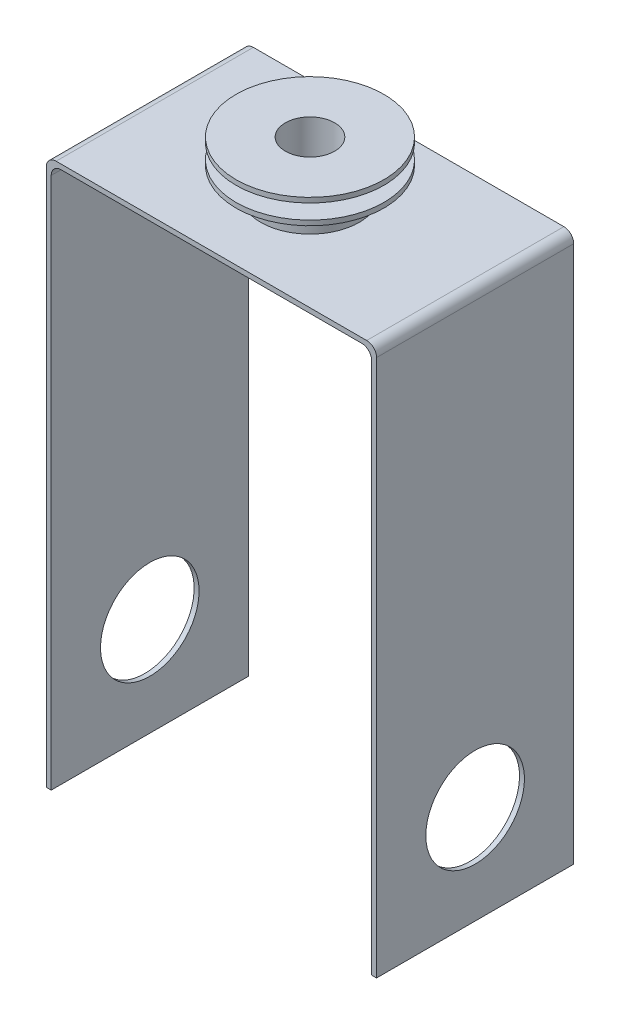
ISO-10303-21;
HEADER;
FILE_DESCRIPTION(('STEP AP214'),'2;1');
FILE_NAME('part.step','',(''),(''),'','','');
FILE_SCHEMA(('AUTOMOTIVE_DESIGN { 1 0 10303 214 1 1 1 1 }'));
ENDSEC;
DATA;
#1=APPLICATION_CONTEXT('core data for automotive mechanical design processes');
#2=APPLICATION_PROTOCOL_DEFINITION('international standard','automotive_design',2000,#1);
#3=PRODUCT_CONTEXT('',#1,'mechanical');
#4=PRODUCT('Part','Part','',(#3));
#5=PRODUCT_RELATED_PRODUCT_CATEGORY('part','',(#4));
#6=PRODUCT_DEFINITION_FORMATION('','',#4);
#7=PRODUCT_DEFINITION_CONTEXT('part definition',#1,'design');
#8=PRODUCT_DEFINITION('design','',#6,#7);
#9=PRODUCT_DEFINITION_SHAPE('','',#8);
#10=(LENGTH_UNIT() NAMED_UNIT(*) SI_UNIT(.MILLI.,.METRE.));
#11=(NAMED_UNIT(*) PLANE_ANGLE_UNIT() SI_UNIT($,.RADIAN.));
#12=(NAMED_UNIT(*) SI_UNIT($,.STERADIAN.) SOLID_ANGLE_UNIT());
#13=UNCERTAINTY_MEASURE_WITH_UNIT(LENGTH_MEASURE(1.E-05),#10,'distance_accuracy_value','');
#14=(GEOMETRIC_REPRESENTATION_CONTEXT(3) GLOBAL_UNCERTAINTY_ASSIGNED_CONTEXT((#13)) GLOBAL_UNIT_ASSIGNED_CONTEXT((#10,
#11,#12)) REPRESENTATION_CONTEXT('',''));
#15=CARTESIAN_POINT('',(0.,0.,0.));
#16=DIRECTION('',(0.,0.,1.));
#17=DIRECTION('',(1.,0.,0.));
#18=AXIS2_PLACEMENT_3D('',#15,#16,#17);
#19=CARTESIAN_POINT('',(-40.005,113.03,50.8));
#20=DIRECTION('',(0.,0.,-1.));
#21=DIRECTION('',(-1.,0.,0.));
#22=AXIS2_PLACEMENT_3D('',#19,#20,#21);
#23=CYLINDRICAL_SURFACE('',#22,2.54);
#24=CARTESIAN_POINT('',(-40.005,113.03,0.));
#25=DIRECTION('',(0.,0.,-1.));
#26=DIRECTION('',(-1.,0.,0.));
#27=AXIS2_PLACEMENT_3D('',#24,#25,#26);
#28=CIRCLE('',#27,2.54);
#29=CARTESIAN_POINT('',(-42.545,113.03,0.));
#30=VERTEX_POINT('',#29);
#31=CARTESIAN_POINT('',(-40.005,115.57,0.));
#32=VERTEX_POINT('',#31);
#33=EDGE_CURVE('E170',#30,#32,#28,.T.);
#34=ORIENTED_EDGE('',*,*,#33,.F.);
#35=DIRECTION('',(0.,0.,-1.));
#36=VECTOR('',#35,1.);
#37=CARTESIAN_POINT('',(-42.545,113.03,50.8));
#38=LINE('',#37,#36);
#39=CARTESIAN_POINT('',(-42.545,113.03,50.8));
#40=VERTEX_POINT('',#39);
#41=EDGE_CURVE('E11',#40,#30,#38,.T.);
#42=ORIENTED_EDGE('',*,*,#41,.F.);
#43=CARTESIAN_POINT('',(-40.005,113.03,50.8));
#44=DIRECTION('',(0.,0.,-1.));
#45=DIRECTION('',(-1.,0.,0.));
#46=AXIS2_PLACEMENT_3D('',#43,#44,#45);
#47=CIRCLE('',#46,2.54);
#48=CARTESIAN_POINT('',(-40.005,115.57,50.8));
#49=VERTEX_POINT('',#48);
#50=EDGE_CURVE('E211',#40,#49,#47,.T.);
#51=ORIENTED_EDGE('',*,*,#50,.T.);
#52=DIRECTION('',(0.,0.,-1.));
#53=VECTOR('',#52,1.);
#54=CARTESIAN_POINT('',(-40.005,115.57,50.8));
#55=LINE('',#54,#53);
#56=EDGE_CURVE('E45',#49,#32,#55,.T.);
#57=ORIENTED_EDGE('',*,*,#56,.T.);
#58=EDGE_LOOP('',(#34,#42,#51,#57));
#59=FACE_BOUND('',#58,.T.);
#60=ADVANCED_FACE('F42',(#59),#23,.T.);
#61=CARTESIAN_POINT('',(-42.545,113.03,50.8));
#62=DIRECTION('',(1.,0.,0.));
#63=DIRECTION('',(0.,0.,-1.));
#64=AXIS2_PLACEMENT_3D('',#61,#62,#63);
#65=PLANE('',#64);
#66=CARTESIAN_POINT('',(-42.545,0.,25.4));
#67=DIRECTION('',(-1.,0.,0.));
#68=DIRECTION('',(0.,0.,1.));
#69=AXIS2_PLACEMENT_3D('',#66,#67,#68);
#70=CIRCLE('',#69,12.7);
#71=CARTESIAN_POINT('',(-42.545,0.,38.1));
#72=VERTEX_POINT('',#71);
#73=EDGE_CURVE('E286',#72,#72,#70,.T.);
#74=ORIENTED_EDGE('',*,*,#73,.F.);
#75=EDGE_LOOP('',(#74));
#76=FACE_BOUND('',#75,.T.);
#77=DIRECTION('',(0.,-1.,0.));
#78=VECTOR('',#77,1.);
#79=CARTESIAN_POINT('',(-42.545,113.03,0.));
#80=LINE('',#79,#78);
#81=CARTESIAN_POINT('',(-42.545,-25.4,0.));
#82=VERTEX_POINT('',#81);
#83=EDGE_CURVE('E100',#30,#82,#80,.T.);
#84=ORIENTED_EDGE('',*,*,#83,.T.);
#85=DIRECTION('',(0.,0.,-1.));
#86=VECTOR('',#85,1.);
#87=CARTESIAN_POINT('',(-42.545,-25.4,50.8));
#88=LINE('',#87,#86);
#89=CARTESIAN_POINT('',(-42.545,-25.4,50.8));
#90=VERTEX_POINT('',#89);
#91=EDGE_CURVE('E52',#90,#82,#88,.T.);
#92=ORIENTED_EDGE('',*,*,#91,.F.);
#93=DIRECTION('',(0.,-1.,0.));
#94=VECTOR('',#93,1.);
#95=CARTESIAN_POINT('',(-42.545,113.03,50.8));
#96=LINE('',#95,#94);
#97=EDGE_CURVE('E143',#40,#90,#96,.T.);
#98=ORIENTED_EDGE('',*,*,#97,.F.);
#99=ORIENTED_EDGE('',*,*,#41,.T.);
#100=EDGE_LOOP('',(#84,#92,#98,#99));
#101=FACE_BOUND('',#100,.T.);
#102=ADVANCED_FACE('F356',(#76,#101),#65,.F.);
#103=CARTESIAN_POINT('',(-42.545,-25.4,50.8));
#104=DIRECTION('',(0.,1.,0.));
#105=DIRECTION('',(-1.,0.,0.));
#106=AXIS2_PLACEMENT_3D('',#103,#104,#105);
#107=PLANE('',#106);
#108=DIRECTION('',(1.,0.,0.));
#109=VECTOR('',#108,1.);
#110=CARTESIAN_POINT('',(-42.545,-25.4,0.));
#111=LINE('',#110,#109);
#112=CARTESIAN_POINT('',(-41.275,-25.4,0.));
#113=VERTEX_POINT('',#112);
#114=EDGE_CURVE('E151',#82,#113,#111,.T.);
#115=ORIENTED_EDGE('',*,*,#114,.T.);
#116=DIRECTION('',(0.,0.,-1.));
#117=VECTOR('',#116,1.);
#118=CARTESIAN_POINT('',(-41.275,-25.4,50.8));
#119=LINE('',#118,#117);
#120=CARTESIAN_POINT('',(-41.275,-25.4,50.8));
#121=VERTEX_POINT('',#120);
#122=EDGE_CURVE('E148',#121,#113,#119,.T.);
#123=ORIENTED_EDGE('',*,*,#122,.F.);
#124=DIRECTION('',(1.,0.,0.));
#125=VECTOR('',#124,1.);
#126=CARTESIAN_POINT('',(-42.545,-25.4,50.8));
#127=LINE('',#126,#125);
#128=EDGE_CURVE('E137',#90,#121,#127,.T.);
#129=ORIENTED_EDGE('',*,*,#128,.F.);
#130=ORIENTED_EDGE('',*,*,#91,.T.);
#131=EDGE_LOOP('',(#115,#123,#129,#130));
#132=FACE_BOUND('',#131,.T.);
#133=ADVANCED_FACE('F149',(#132),#107,.F.);
#134=CARTESIAN_POINT('',(-41.275,111.76,50.8));
#135=DIRECTION('',(1.,0.,0.));
#136=DIRECTION('',(0.,1.,0.));
#137=AXIS2_PLACEMENT_3D('',#134,#135,#136);
#138=PLANE('',#137);
#139=CARTESIAN_POINT('',(-41.275,0.,25.4));
#140=DIRECTION('',(1.,0.,0.));
#141=DIRECTION('',(0.,1.,0.));
#142=AXIS2_PLACEMENT_3D('',#139,#140,#141);
#143=CIRCLE('',#142,12.7);
#144=CARTESIAN_POINT('',(-41.275,12.7,25.4));
#145=VERTEX_POINT('',#144);
#146=EDGE_CURVE('E175',#145,#145,#143,.T.);
#147=ORIENTED_EDGE('',*,*,#146,.F.);
#148=EDGE_LOOP('',(#147));
#149=FACE_BOUND('',#148,.T.);
#150=DIRECTION('',(0.,-1.,0.));
#151=VECTOR('',#150,1.);
#152=CARTESIAN_POINT('',(-41.275,111.76,0.));
#153=LINE('',#152,#151);
#154=CARTESIAN_POINT('',(-41.275,111.76,0.));
#155=VERTEX_POINT('',#154);
#156=EDGE_CURVE('E205',#155,#113,#153,.T.);
#157=ORIENTED_EDGE('',*,*,#156,.F.);
#158=DIRECTION('',(0.,0.,-1.));
#159=VECTOR('',#158,1.);
#160=CARTESIAN_POINT('',(-41.275,111.76,50.8));
#161=LINE('',#160,#159);
#162=CARTESIAN_POINT('',(-41.275,111.76,50.8));
#163=VERTEX_POINT('',#162);
#164=EDGE_CURVE('E156',#163,#155,#161,.T.);
#165=ORIENTED_EDGE('',*,*,#164,.F.);
#166=DIRECTION('',(0.,-1.,0.));
#167=VECTOR('',#166,1.);
#168=CARTESIAN_POINT('',(-41.275,111.76,50.8));
#169=LINE('',#168,#167);
#170=EDGE_CURVE('E142',#163,#121,#169,.T.);
#171=ORIENTED_EDGE('',*,*,#170,.T.);
#172=ORIENTED_EDGE('',*,*,#122,.T.);
#173=EDGE_LOOP('',(#157,#165,#171,#172));
#174=FACE_BOUND('',#173,.T.);
#175=ADVANCED_FACE('F158',(#149,#174),#138,.T.);
#176=CARTESIAN_POINT('',(-38.735,111.76,50.8));
#177=DIRECTION('',(0.,0.,-1.));
#178=DIRECTION('',(-1.,0.,0.));
#179=AXIS2_PLACEMENT_3D('',#176,#177,#178);
#180=CYLINDRICAL_SURFACE('',#179,2.54);
#181=CARTESIAN_POINT('',(-38.735,111.76,0.));
#182=DIRECTION('',(0.,0.,-1.));
#183=DIRECTION('',(-1.,0.,0.));
#184=AXIS2_PLACEMENT_3D('',#181,#182,#183);
#185=CIRCLE('',#184,2.54);
#186=CARTESIAN_POINT('',(-38.735,114.3,0.));
#187=VERTEX_POINT('',#186);
#188=EDGE_CURVE('E202',#155,#187,#185,.T.);
#189=ORIENTED_EDGE('',*,*,#188,.T.);
#190=DIRECTION('',(0.,0.,-1.));
#191=VECTOR('',#190,1.);
#192=CARTESIAN_POINT('',(-38.735,114.3,50.8));
#193=LINE('',#192,#191);
#194=CARTESIAN_POINT('',(-38.735,114.3,50.8));
#195=VERTEX_POINT('',#194);
#196=EDGE_CURVE('E217',#195,#187,#193,.T.);
#197=ORIENTED_EDGE('',*,*,#196,.F.);
#198=CARTESIAN_POINT('',(-38.735,111.76,50.8));
#199=DIRECTION('',(0.,0.,-1.));
#200=DIRECTION('',(-1.,0.,0.));
#201=AXIS2_PLACEMENT_3D('',#198,#199,#200);
#202=CIRCLE('',#201,2.54);
#203=EDGE_CURVE('E161',#163,#195,#202,.T.);
#204=ORIENTED_EDGE('',*,*,#203,.F.);
#205=ORIENTED_EDGE('',*,*,#164,.T.);
#206=EDGE_LOOP('',(#189,#197,#204,#205));
#207=FACE_BOUND('',#206,.T.);
#208=ADVANCED_FACE('F248',(#207),#180,.F.);
#209=CARTESIAN_POINT('',(-38.735,114.3,50.8));
#210=DIRECTION('',(0.,1.,0.));
#211=DIRECTION('',(0.,0.,1.));
#212=AXIS2_PLACEMENT_3D('',#209,#210,#211);
#213=PLANE('',#212);
#214=CARTESIAN_POINT('',(0.,114.3,25.4));
#215=DIRECTION('',(0.,1.,0.));
#216=DIRECTION('',(0.,0.,1.));
#217=AXIS2_PLACEMENT_3D('',#214,#215,#216);
#218=CIRCLE('',#217,6.35);
#219=CARTESIAN_POINT('',(0.,114.3,31.75));
#220=VERTEX_POINT('',#219);
#221=EDGE_CURVE('E306',#220,#220,#218,.F.);
#222=ORIENTED_EDGE('',*,*,#221,.F.);
#223=EDGE_LOOP('',(#222));
#224=FACE_BOUND('',#223,.T.);
#225=DIRECTION('',(1.,0.,0.));
#226=VECTOR('',#225,1.);
#227=CARTESIAN_POINT('',(-38.735,114.3,0.));
#228=LINE('',#227,#226);
#229=CARTESIAN_POINT('',(38.735,114.3,0.));
#230=VERTEX_POINT('',#229);
#231=EDGE_CURVE('E198',#187,#230,#228,.T.);
#232=ORIENTED_EDGE('',*,*,#231,.T.);
#233=DIRECTION('',(0.,0.,-1.));
#234=VECTOR('',#233,1.);
#235=CARTESIAN_POINT('',(38.735,114.3,50.8));
#236=LINE('',#235,#234);
#237=CARTESIAN_POINT('',(38.735,114.3,50.8));
#238=VERTEX_POINT('',#237);
#239=EDGE_CURVE('E221',#238,#230,#236,.T.);
#240=ORIENTED_EDGE('',*,*,#239,.F.);
#241=DIRECTION('',(1.,0.,0.));
#242=VECTOR('',#241,1.);
#243=CARTESIAN_POINT('',(-38.735,114.3,50.8));
#244=LINE('',#243,#242);
#245=EDGE_CURVE('E164',#195,#238,#244,.T.);
#246=ORIENTED_EDGE('',*,*,#245,.F.);
#247=ORIENTED_EDGE('',*,*,#196,.T.);
#248=EDGE_LOOP('',(#232,#240,#246,#247));
#249=FACE_BOUND('',#248,.T.);
#250=ADVANCED_FACE('F251',(#224,#249),#213,.F.);
#251=CARTESIAN_POINT('',(38.735,111.76,50.8));
#252=DIRECTION('',(0.,0.,-1.));
#253=DIRECTION('',(-1.,0.,0.));
#254=AXIS2_PLACEMENT_3D('',#251,#252,#253);
#255=CYLINDRICAL_SURFACE('',#254,2.54);
#256=CARTESIAN_POINT('',(38.735,111.76,0.));
#257=DIRECTION('',(0.,0.,1.));
#258=DIRECTION('',(1.,0.,0.));
#259=AXIS2_PLACEMENT_3D('',#256,#257,#258);
#260=CIRCLE('',#259,2.54);
#261=CARTESIAN_POINT('',(41.275,111.76,0.));
#262=VERTEX_POINT('',#261);
#263=EDGE_CURVE('E194',#262,#230,#260,.T.);
#264=ORIENTED_EDGE('',*,*,#263,.F.);
#265=DIRECTION('',(0.,0.,-1.));
#266=VECTOR('',#265,1.);
#267=CARTESIAN_POINT('',(41.275,111.76,50.8));
#268=LINE('',#267,#266);
#269=CARTESIAN_POINT('',(41.275,111.76,50.8));
#270=VERTEX_POINT('',#269);
#271=EDGE_CURVE('E224',#270,#262,#268,.T.);
#272=ORIENTED_EDGE('',*,*,#271,.F.);
#273=CARTESIAN_POINT('',(38.735,111.76,50.8));
#274=DIRECTION('',(0.,0.,1.));
#275=DIRECTION('',(1.,0.,0.));
#276=AXIS2_PLACEMENT_3D('',#273,#274,#275);
#277=CIRCLE('',#276,2.54);
#278=EDGE_CURVE('E256',#270,#238,#277,.T.);
#279=ORIENTED_EDGE('',*,*,#278,.T.);
#280=ORIENTED_EDGE('',*,*,#239,.T.);
#281=EDGE_LOOP('',(#264,#272,#279,#280));
#282=FACE_BOUND('',#281,.T.);
#283=ADVANCED_FACE('F377',(#282),#255,.F.);
#284=CARTESIAN_POINT('',(41.275,111.76,50.8));
#285=DIRECTION('',(1.,0.,0.));
#286=DIRECTION('',(0.,1.,0.));
#287=AXIS2_PLACEMENT_3D('',#284,#285,#286);
#288=PLANE('',#287);
#289=CARTESIAN_POINT('',(41.275,0.,25.4));
#290=DIRECTION('',(1.,0.,0.));
#291=DIRECTION('',(0.,1.,0.));
#292=AXIS2_PLACEMENT_3D('',#289,#290,#291);
#293=CIRCLE('',#292,12.7);
#294=CARTESIAN_POINT('',(41.275,12.7,25.4));
#295=VERTEX_POINT('',#294);
#296=EDGE_CURVE('E281',#295,#295,#293,.T.);
#297=ORIENTED_EDGE('',*,*,#296,.T.);
#298=EDGE_LOOP('',(#297));
#299=FACE_BOUND('',#298,.T.);
#300=DIRECTION('',(0.,-1.,0.));
#301=VECTOR('',#300,1.);
#302=CARTESIAN_POINT('',(41.275,111.76,0.));
#303=LINE('',#302,#301);
#304=CARTESIAN_POINT('',(41.275,-25.4,0.));
#305=VERTEX_POINT('',#304);
#306=EDGE_CURVE('E191',#262,#305,#303,.T.);
#307=ORIENTED_EDGE('',*,*,#306,.T.);
#308=DIRECTION('',(0.,0.,-1.));
#309=VECTOR('',#308,1.);
#310=CARTESIAN_POINT('',(41.275,-25.4,50.8));
#311=LINE('',#310,#309);
#312=CARTESIAN_POINT('',(41.275,-25.4,50.8));
#313=VERTEX_POINT('',#312);
#314=EDGE_CURVE('E227',#313,#305,#311,.T.);
#315=ORIENTED_EDGE('',*,*,#314,.F.);
#316=DIRECTION('',(0.,-1.,0.));
#317=VECTOR('',#316,1.);
#318=CARTESIAN_POINT('',(41.275,111.76,50.8));
#319=LINE('',#318,#317);
#320=EDGE_CURVE('E258',#270,#313,#319,.T.);
#321=ORIENTED_EDGE('',*,*,#320,.F.);
#322=ORIENTED_EDGE('',*,*,#271,.T.);
#323=EDGE_LOOP('',(#307,#315,#321,#322));
#324=FACE_BOUND('',#323,.T.);
#325=ADVANCED_FACE('F381',(#299,#324),#288,.F.);
#326=CARTESIAN_POINT('',(41.275,-25.4,50.8));
#327=DIRECTION('',(0.,1.,0.));
#328=DIRECTION('',(-1.,0.,0.));
#329=AXIS2_PLACEMENT_3D('',#326,#327,#328);
#330=PLANE('',#329);
#331=DIRECTION('',(1.,0.,0.));
#332=VECTOR('',#331,1.);
#333=CARTESIAN_POINT('',(41.275,-25.4,0.));
#334=LINE('',#333,#332);
#335=CARTESIAN_POINT('',(42.545,-25.4,0.));
#336=VERTEX_POINT('',#335);
#337=EDGE_CURVE('E187',#305,#336,#334,.T.);
#338=ORIENTED_EDGE('',*,*,#337,.T.);
#339=DIRECTION('',(0.,0.,-1.));
#340=VECTOR('',#339,1.);
#341=CARTESIAN_POINT('',(42.545,-25.4,50.8));
#342=LINE('',#341,#340);
#343=CARTESIAN_POINT('',(42.545,-25.4,50.8));
#344=VERTEX_POINT('',#343);
#345=EDGE_CURVE('E231',#344,#336,#342,.T.);
#346=ORIENTED_EDGE('',*,*,#345,.F.);
#347=DIRECTION('',(1.,0.,0.));
#348=VECTOR('',#347,1.);
#349=CARTESIAN_POINT('',(41.275,-25.4,50.8));
#350=LINE('',#349,#348);
#351=EDGE_CURVE('E263',#313,#344,#350,.T.);
#352=ORIENTED_EDGE('',*,*,#351,.F.);
#353=ORIENTED_EDGE('',*,*,#314,.T.);
#354=EDGE_LOOP('',(#338,#346,#352,#353));
#355=FACE_BOUND('',#354,.T.);
#356=ADVANCED_FACE('F385',(#355),#330,.F.);
#357=CARTESIAN_POINT('',(42.545,113.03,50.8));
#358=DIRECTION('',(1.,0.,0.));
#359=DIRECTION('',(0.,1.,0.));
#360=AXIS2_PLACEMENT_3D('',#357,#358,#359);
#361=PLANE('',#360);
#362=CARTESIAN_POINT('',(42.545,0.,25.4));
#363=DIRECTION('',(-1.,0.,0.));
#364=DIRECTION('',(0.,0.,1.));
#365=AXIS2_PLACEMENT_3D('',#362,#363,#364);
#366=CIRCLE('',#365,12.7);
#367=CARTESIAN_POINT('',(42.545,0.,38.1));
#368=VERTEX_POINT('',#367);
#369=EDGE_CURVE('E285',#368,#368,#366,.T.);
#370=ORIENTED_EDGE('',*,*,#369,.T.);
#371=EDGE_LOOP('',(#370));
#372=FACE_BOUND('',#371,.T.);
#373=DIRECTION('',(0.,-1.,0.));
#374=VECTOR('',#373,1.);
#375=CARTESIAN_POINT('',(42.545,113.03,0.));
#376=LINE('',#375,#374);
#377=CARTESIAN_POINT('',(42.545,113.03,0.));
#378=VERTEX_POINT('',#377);
#379=EDGE_CURVE('E183',#378,#336,#376,.T.);
#380=ORIENTED_EDGE('',*,*,#379,.F.);
#381=DIRECTION('',(0.,0.,-1.));
#382=VECTOR('',#381,1.);
#383=CARTESIAN_POINT('',(42.545,113.03,50.8));
#384=LINE('',#383,#382);
#385=CARTESIAN_POINT('',(42.545,113.03,50.8));
#386=VERTEX_POINT('',#385);
#387=EDGE_CURVE('E234',#386,#378,#384,.T.);
#388=ORIENTED_EDGE('',*,*,#387,.F.);
#389=DIRECTION('',(0.,-1.,0.));
#390=VECTOR('',#389,1.);
#391=CARTESIAN_POINT('',(42.545,113.03,50.8));
#392=LINE('',#391,#390);
#393=EDGE_CURVE('E266',#386,#344,#392,.T.);
#394=ORIENTED_EDGE('',*,*,#393,.T.);
#395=ORIENTED_EDGE('',*,*,#345,.T.);
#396=EDGE_LOOP('',(#380,#388,#394,#395));
#397=FACE_BOUND('',#396,.T.);
#398=ADVANCED_FACE('F389',(#372,#397),#361,.T.);
#399=CARTESIAN_POINT('',(40.005,113.03,50.8));
#400=DIRECTION('',(0.,0.,-1.));
#401=DIRECTION('',(-1.,0.,0.));
#402=AXIS2_PLACEMENT_3D('',#399,#400,#401);
#403=CYLINDRICAL_SURFACE('',#402,2.54);
#404=CARTESIAN_POINT('',(40.005,113.03,0.));
#405=DIRECTION('',(0.,0.,1.));
#406=DIRECTION('',(1.,0.,0.));
#407=AXIS2_PLACEMENT_3D('',#404,#405,#406);
#408=CIRCLE('',#407,2.54);
#409=CARTESIAN_POINT('',(40.005,115.57,0.));
#410=VERTEX_POINT('',#409);
#411=EDGE_CURVE('E179',#378,#410,#408,.T.);
#412=ORIENTED_EDGE('',*,*,#411,.T.);
#413=DIRECTION('',(0.,0.,-1.));
#414=VECTOR('',#413,1.);
#415=CARTESIAN_POINT('',(40.005,115.57,50.8));
#416=LINE('',#415,#414);
#417=CARTESIAN_POINT('',(40.005,115.57,50.8));
#418=VERTEX_POINT('',#417);
#419=EDGE_CURVE('E236',#418,#410,#416,.T.);
#420=ORIENTED_EDGE('',*,*,#419,.F.);
#421=CARTESIAN_POINT('',(40.005,113.03,50.8));
#422=DIRECTION('',(0.,0.,1.));
#423=DIRECTION('',(1.,0.,0.));
#424=AXIS2_PLACEMENT_3D('',#421,#422,#423);
#425=CIRCLE('',#424,2.54);
#426=EDGE_CURVE('E270',#386,#418,#425,.T.);
#427=ORIENTED_EDGE('',*,*,#426,.F.);
#428=ORIENTED_EDGE('',*,*,#387,.T.);
#429=EDGE_LOOP('',(#412,#420,#427,#428));
#430=FACE_BOUND('',#429,.T.);
#431=ADVANCED_FACE('F393',(#430),#403,.T.);
#432=CARTESIAN_POINT('',(-40.005,115.57,50.8));
#433=DIRECTION('',(0.,1.,0.));
#434=DIRECTION('',(0.,0.,1.));
#435=AXIS2_PLACEMENT_3D('',#432,#433,#434);
#436=PLANE('',#435);
#437=CARTESIAN_POINT('',(0.,115.57,25.4));
#438=DIRECTION('',(0.,1.,0.));
#439=DIRECTION('',(0.,0.,1.));
#440=AXIS2_PLACEMENT_3D('',#437,#438,#439);
#441=CIRCLE('',#440,12.7);
#442=CARTESIAN_POINT('',(0.,115.57,38.1));
#443=VERTEX_POINT('',#442);
#444=EDGE_CURVE('E294',#443,#443,#441,.T.);
#445=ORIENTED_EDGE('',*,*,#444,.F.);
#446=EDGE_LOOP('',(#445));
#447=FACE_BOUND('',#446,.T.);
#448=DIRECTION('',(1.,0.,0.));
#449=VECTOR('',#448,1.);
#450=CARTESIAN_POINT('',(-40.005,115.57,0.));
#451=LINE('',#450,#449);
#452=EDGE_CURVE('E174',#32,#410,#451,.T.);
#453=ORIENTED_EDGE('',*,*,#452,.F.);
#454=ORIENTED_EDGE('',*,*,#56,.F.);
#455=DIRECTION('',(1.,0.,0.));
#456=VECTOR('',#455,1.);
#457=CARTESIAN_POINT('',(-40.005,115.57,50.8));
#458=LINE('',#457,#456);
#459=EDGE_CURVE('E273',#49,#418,#458,.T.);
#460=ORIENTED_EDGE('',*,*,#459,.T.);
#461=ORIENTED_EDGE('',*,*,#419,.T.);
#462=EDGE_LOOP('',(#453,#454,#460,#461));
#463=FACE_BOUND('',#462,.T.);
#464=ADVANCED_FACE('F240',(#447,#463),#436,.T.);
#465=CARTESIAN_POINT('',(-40.005,113.03,50.8));
#466=DIRECTION('',(0.,0.,-1.));
#467=DIRECTION('',(-1.,0.,0.));
#468=AXIS2_PLACEMENT_3D('',#465,#466,#467);
#469=PLANE('',#468);
#470=ORIENTED_EDGE('',*,*,#50,.F.);
#471=ORIENTED_EDGE('',*,*,#97,.T.);
#472=ORIENTED_EDGE('',*,*,#128,.T.);
#473=ORIENTED_EDGE('',*,*,#170,.F.);
#474=ORIENTED_EDGE('',*,*,#203,.T.);
#475=ORIENTED_EDGE('',*,*,#245,.T.);
#476=ORIENTED_EDGE('',*,*,#278,.F.);
#477=ORIENTED_EDGE('',*,*,#320,.T.);
#478=ORIENTED_EDGE('',*,*,#351,.T.);
#479=ORIENTED_EDGE('',*,*,#393,.F.);
#480=ORIENTED_EDGE('',*,*,#426,.T.);
#481=ORIENTED_EDGE('',*,*,#459,.F.);
#482=EDGE_LOOP('',(#470,#471,#472,#473,#474,#475,#476,#477,#478,#479,#480,#481));
#483=FACE_BOUND('',#482,.T.);
#484=ADVANCED_FACE('F140',(#483),#469,.F.);
#485=CARTESIAN_POINT('',(-40.005,113.03,0.));
#486=DIRECTION('',(0.,0.,-1.));
#487=DIRECTION('',(-1.,0.,0.));
#488=AXIS2_PLACEMENT_3D('',#485,#486,#487);
#489=PLANE('',#488);
#490=ORIENTED_EDGE('',*,*,#33,.T.);
#491=ORIENTED_EDGE('',*,*,#452,.T.);
#492=ORIENTED_EDGE('',*,*,#411,.F.);
#493=ORIENTED_EDGE('',*,*,#379,.T.);
#494=ORIENTED_EDGE('',*,*,#337,.F.);
#495=ORIENTED_EDGE('',*,*,#306,.F.);
#496=ORIENTED_EDGE('',*,*,#263,.T.);
#497=ORIENTED_EDGE('',*,*,#231,.F.);
#498=ORIENTED_EDGE('',*,*,#188,.F.);
#499=ORIENTED_EDGE('',*,*,#156,.T.);
#500=ORIENTED_EDGE('',*,*,#114,.F.);
#501=ORIENTED_EDGE('',*,*,#83,.F.);
#502=EDGE_LOOP('',(#490,#491,#492,#493,#494,#495,#496,#497,#498,#499,#500,#501));
#503=FACE_BOUND('',#502,.T.);
#504=ADVANCED_FACE('F243',(#503),#489,.T.);
#505=CARTESIAN_POINT('',(42.545,0.,25.4));
#506=DIRECTION('',(-1.,0.,0.));
#507=DIRECTION('',(0.,0.,1.));
#508=AXIS2_PLACEMENT_3D('',#505,#506,#507);
#509=CYLINDRICAL_SURFACE('',#508,12.7);
#510=ORIENTED_EDGE('',*,*,#369,.F.);
#511=EDGE_LOOP('',(#510));
#512=FACE_BOUND('',#511,.T.);
#513=ORIENTED_EDGE('',*,*,#296,.F.);
#514=EDGE_LOOP('',(#513));
#515=FACE_BOUND('',#514,.T.);
#516=ADVANCED_FACE('F417',(#512,#515),#509,.F.);
#517=ORIENTED_EDGE('',*,*,#146,.T.);
#518=EDGE_LOOP('',(#517));
#519=FACE_BOUND('',#518,.T.);
#520=ORIENTED_EDGE('',*,*,#73,.T.);
#521=EDGE_LOOP('',(#520));
#522=FACE_BOUND('',#521,.T.);
#523=ADVANCED_FACE('F407',(#519,#522),#509,.F.);
#524=CARTESIAN_POINT('',(0.,121.92,25.4));
#525=DIRECTION('',(0.,-1.,0.));
#526=DIRECTION('',(0.,0.,-1.));
#527=AXIS2_PLACEMENT_3D('',#524,#525,#526);
#528=CYLINDRICAL_SURFACE('',#527,12.7);
#529=CARTESIAN_POINT('',(0.,121.92,25.4));
#530=DIRECTION('',(0.,1.,0.));
#531=DIRECTION('',(0.,0.,1.));
#532=AXIS2_PLACEMENT_3D('',#529,#530,#531);
#533=CIRCLE('',#532,12.7);
#534=CARTESIAN_POINT('',(0.,121.92,38.1));
#535=VERTEX_POINT('',#534);
#536=EDGE_CURVE('E290',#535,#535,#533,.T.);
#537=ORIENTED_EDGE('',*,*,#536,.F.);
#538=EDGE_LOOP('',(#537));
#539=FACE_BOUND('',#538,.T.);
#540=ORIENTED_EDGE('',*,*,#444,.T.);
#541=EDGE_LOOP('',(#540));
#542=FACE_BOUND('',#541,.T.);
#543=ADVANCED_FACE('F404',(#539,#542),#528,.T.);
#544=CARTESIAN_POINT('',(0.,123.19,25.4));
#545=DIRECTION('',(0.,-1.,0.));
#546=DIRECTION('',(0.,0.,-1.));
#547=AXIS2_PLACEMENT_3D('',#544,#545,#546);
#548=CYLINDRICAL_SURFACE('',#547,19.05);
#549=CARTESIAN_POINT('',(0.,123.19,25.4));
#550=DIRECTION('',(0.,1.,0.));
#551=DIRECTION('',(0.,0.,1.));
#552=AXIS2_PLACEMENT_3D('',#549,#550,#551);
#553=CIRCLE('',#552,19.05);
#554=CARTESIAN_POINT('',(0.,123.19,44.45));
#555=VERTEX_POINT('',#554);
#556=EDGE_CURVE('E298',#555,#555,#553,.T.);
#557=ORIENTED_EDGE('',*,*,#556,.F.);
#558=EDGE_LOOP('',(#557));
#559=FACE_BOUND('',#558,.T.);
#560=CARTESIAN_POINT('',(0.,121.92,25.4));
#561=DIRECTION('',(0.,1.,0.));
#562=DIRECTION('',(0.,0.,1.));
#563=AXIS2_PLACEMENT_3D('',#560,#561,#562);
#564=CIRCLE('',#563,19.05);
#565=CARTESIAN_POINT('',(0.,121.92,44.45));
#566=VERTEX_POINT('',#565);
#567=EDGE_CURVE('E302',#566,#566,#564,.T.);
#568=ORIENTED_EDGE('',*,*,#567,.T.);
#569=EDGE_LOOP('',(#568));
#570=FACE_BOUND('',#569,.T.);
#571=ADVANCED_FACE('F406',(#559,#570),#548,.T.);
#572=CARTESIAN_POINT('',(0.,123.19,25.4));
#573=DIRECTION('',(0.,1.,0.));
#574=DIRECTION('',(0.,0.,1.));
#575=AXIS2_PLACEMENT_3D('',#572,#573,#574);
#576=PLANE('',#575);
#577=CARTESIAN_POINT('',(0.,123.19,25.4));
#578=DIRECTION('',(0.,1.,0.));
#579=DIRECTION('',(0.,0.,1.));
#580=AXIS2_PLACEMENT_3D('',#577,#578,#579);
#581=CIRCLE('',#580,12.7);
#582=CARTESIAN_POINT('',(0.,123.19,38.1));
#583=VERTEX_POINT('',#582);
#584=EDGE_CURVE('E314',#583,#583,#581,.T.);
#585=ORIENTED_EDGE('',*,*,#584,.F.);
#586=EDGE_LOOP('',(#585));
#587=FACE_BOUND('',#586,.T.);
#588=ORIENTED_EDGE('',*,*,#556,.T.);
#589=EDGE_LOOP('',(#588));
#590=FACE_BOUND('',#589,.T.);
#591=ADVANCED_FACE('F414',(#587,#590),#576,.T.);
#592=CARTESIAN_POINT('',(0.,121.92,25.4));
#593=DIRECTION('',(0.,1.,0.));
#594=DIRECTION('',(0.,0.,1.));
#595=AXIS2_PLACEMENT_3D('',#592,#593,#594);
#596=PLANE('',#595);
#597=ORIENTED_EDGE('',*,*,#536,.T.);
#598=EDGE_LOOP('',(#597));
#599=FACE_BOUND('',#598,.T.);
#600=ORIENTED_EDGE('',*,*,#567,.F.);
#601=EDGE_LOOP('',(#600));
#602=FACE_BOUND('',#601,.T.);
#603=ADVANCED_FACE('F422',(#599,#602),#596,.F.);
#604=CARTESIAN_POINT('',(0.,-25.401,25.4));
#605=DIRECTION('',(0.,1.,0.));
#606=DIRECTION('',(0.,0.,1.));
#607=AXIS2_PLACEMENT_3D('',#604,#605,#606);
#608=CYLINDRICAL_SURFACE('',#607,6.35);
#609=ORIENTED_EDGE('',*,*,#221,.T.);
#610=EDGE_LOOP('',(#609));
#611=FACE_BOUND('',#610,.T.);
#612=CARTESIAN_POINT('',(0.,128.27,25.4));
#613=DIRECTION('',(0.,1.,0.));
#614=DIRECTION('',(0.,0.,1.));
#615=AXIS2_PLACEMENT_3D('',#612,#613,#614);
#616=CIRCLE('',#615,6.35);
#617=CARTESIAN_POINT('',(0.,128.27,31.75));
#618=VERTEX_POINT('',#617);
#619=EDGE_CURVE('E326',#618,#618,#616,.T.);
#620=ORIENTED_EDGE('',*,*,#619,.T.);
#621=EDGE_LOOP('',(#620));
#622=FACE_BOUND('',#621,.T.);
#623=ADVANCED_FACE('F334',(#611,#622),#608,.F.);
#624=CARTESIAN_POINT('',(0.,127.,25.4));
#625=DIRECTION('',(0.,-1.,0.));
#626=DIRECTION('',(0.,0.,-1.));
#627=AXIS2_PLACEMENT_3D('',#624,#625,#626);
#628=CYLINDRICAL_SURFACE('',#627,12.7);
#629=CARTESIAN_POINT('',(0.,127.,25.4));
#630=DIRECTION('',(0.,1.,0.));
#631=DIRECTION('',(0.,0.,1.));
#632=AXIS2_PLACEMENT_3D('',#629,#630,#631);
#633=CIRCLE('',#632,12.7);
#634=CARTESIAN_POINT('',(0.,127.,38.1));
#635=VERTEX_POINT('',#634);
#636=EDGE_CURVE('E313',#635,#635,#633,.T.);
#637=ORIENTED_EDGE('',*,*,#636,.F.);
#638=EDGE_LOOP('',(#637));
#639=FACE_BOUND('',#638,.T.);
#640=ORIENTED_EDGE('',*,*,#584,.T.);
#641=EDGE_LOOP('',(#640));
#642=FACE_BOUND('',#641,.T.);
#643=ADVANCED_FACE('F346',(#639,#642),#628,.T.);
#644=CARTESIAN_POINT('',(0.,128.27,25.4));
#645=DIRECTION('',(0.,-1.,0.));
#646=DIRECTION('',(0.,0.,-1.));
#647=AXIS2_PLACEMENT_3D('',#644,#645,#646);
#648=CYLINDRICAL_SURFACE('',#647,19.05);
#649=CARTESIAN_POINT('',(0.,128.27,25.4));
#650=DIRECTION('',(0.,1.,0.));
#651=DIRECTION('',(0.,0.,1.));
#652=AXIS2_PLACEMENT_3D('',#649,#650,#651);
#653=CIRCLE('',#652,19.05);
#654=CARTESIAN_POINT('',(0.,128.27,44.45));
#655=VERTEX_POINT('',#654);
#656=EDGE_CURVE('E318',#655,#655,#653,.T.);
#657=ORIENTED_EDGE('',*,*,#656,.F.);
#658=EDGE_LOOP('',(#657));
#659=FACE_BOUND('',#658,.T.);
#660=CARTESIAN_POINT('',(0.,127.,25.4));
#661=DIRECTION('',(0.,1.,0.));
#662=DIRECTION('',(0.,0.,1.));
#663=AXIS2_PLACEMENT_3D('',#660,#661,#662);
#664=CIRCLE('',#663,19.05);
#665=CARTESIAN_POINT('',(0.,127.,44.45));
#666=VERTEX_POINT('',#665);
#667=EDGE_CURVE('E322',#666,#666,#664,.T.);
#668=ORIENTED_EDGE('',*,*,#667,.T.);
#669=EDGE_LOOP('',(#668));
#670=FACE_BOUND('',#669,.T.);
#671=ADVANCED_FACE('F340',(#659,#670),#648,.T.);
#672=CARTESIAN_POINT('',(0.,128.27,25.4));
#673=DIRECTION('',(0.,1.,0.));
#674=DIRECTION('',(0.,0.,1.));
#675=AXIS2_PLACEMENT_3D('',#672,#673,#674);
#676=PLANE('',#675);
#677=ORIENTED_EDGE('',*,*,#619,.F.);
#678=EDGE_LOOP('',(#677));
#679=FACE_BOUND('',#678,.T.);
#680=ORIENTED_EDGE('',*,*,#656,.T.);
#681=EDGE_LOOP('',(#680));
#682=FACE_BOUND('',#681,.T.);
#683=ADVANCED_FACE('F336',(#679,#682),#676,.T.);
#684=CARTESIAN_POINT('',(0.,127.,25.4));
#685=DIRECTION('',(0.,1.,0.));
#686=DIRECTION('',(0.,0.,1.));
#687=AXIS2_PLACEMENT_3D('',#684,#685,#686);
#688=PLANE('',#687);
#689=ORIENTED_EDGE('',*,*,#636,.T.);
#690=EDGE_LOOP('',(#689));
#691=FACE_BOUND('',#690,.T.);
#692=ORIENTED_EDGE('',*,*,#667,.F.);
#693=EDGE_LOOP('',(#692));
#694=FACE_BOUND('',#693,.T.);
#695=ADVANCED_FACE('F339',(#691,#694),#688,.F.);
#696=CLOSED_SHELL('',(#60,#102,#133,#175,#208,#250,#283,#325,#356,#398,#431,#464,#484,#504,#516,
#523,#543,#571,#591,#603,#623,#643,#671,#683,#695));
#697=MANIFOLD_SOLID_BREP('B2',#696);
#698=ADVANCED_BREP_SHAPE_REPRESENTATION('',(#18,#697),#14);
#699=SHAPE_DEFINITION_REPRESENTATION(#9,#698);
ENDSEC;
END-ISO-10303-21;
